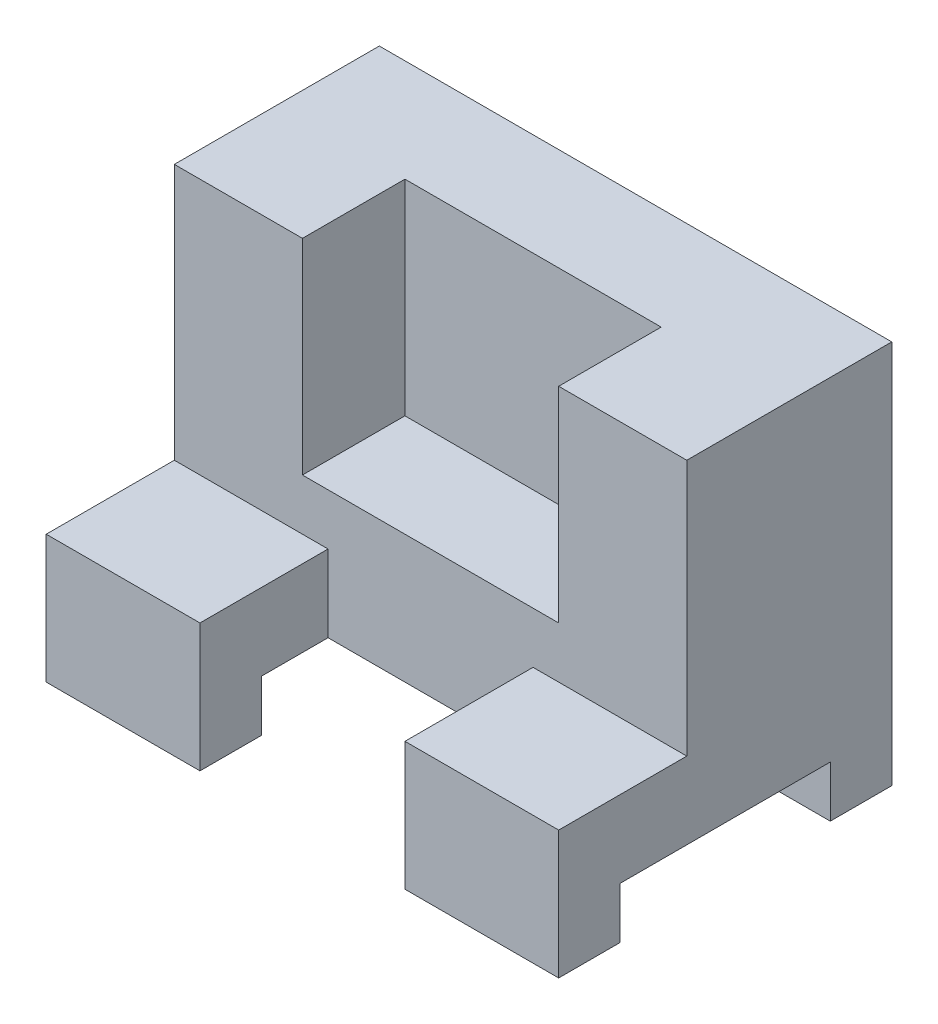
ISO-10303-21;
HEADER;
FILE_DESCRIPTION(('STEP AP214'),'2;1');
FILE_NAME('part.step','',(''),(''),'','','');
FILE_SCHEMA(('AUTOMOTIVE_DESIGN { 1 0 10303 214 1 1 1 1 }'));
ENDSEC;
DATA;
#1=APPLICATION_CONTEXT('core data for automotive mechanical design processes');
#2=APPLICATION_PROTOCOL_DEFINITION('international standard','automotive_design',2000,#1);
#3=PRODUCT_CONTEXT('',#1,'mechanical');
#4=PRODUCT('Part','Part','',(#3));
#5=PRODUCT_RELATED_PRODUCT_CATEGORY('part','',(#4));
#6=PRODUCT_DEFINITION_FORMATION('','',#4);
#7=PRODUCT_DEFINITION_CONTEXT('part definition',#1,'design');
#8=PRODUCT_DEFINITION('design','',#6,#7);
#9=PRODUCT_DEFINITION_SHAPE('','',#8);
#10=(LENGTH_UNIT() NAMED_UNIT(*) SI_UNIT(.MILLI.,.METRE.));
#11=(NAMED_UNIT(*) PLANE_ANGLE_UNIT() SI_UNIT($,.RADIAN.));
#12=(NAMED_UNIT(*) SI_UNIT($,.STERADIAN.) SOLID_ANGLE_UNIT());
#13=UNCERTAINTY_MEASURE_WITH_UNIT(LENGTH_MEASURE(1.E-05),#10,'distance_accuracy_value','');
#14=(GEOMETRIC_REPRESENTATION_CONTEXT(3) GLOBAL_UNCERTAINTY_ASSIGNED_CONTEXT((#13)) GLOBAL_UNIT_ASSIGNED_CONTEXT((#10,
#11,#12)) REPRESENTATION_CONTEXT('',''));
#15=CARTESIAN_POINT('',(0.,0.,0.));
#16=DIRECTION('',(0.,0.,1.));
#17=DIRECTION('',(1.,0.,0.));
#18=AXIS2_PLACEMENT_3D('',#15,#16,#17);
#19=CARTESIAN_POINT('',(-56.1561561561562,75.,22.5075075075075));
#20=DIRECTION('',(0.,0.,-1.));
#21=DIRECTION('',(-1.,0.,0.));
#22=AXIS2_PLACEMENT_3D('',#19,#20,#21);
#23=PLANE('',#22);
#24=DIRECTION('',(0.,1.,0.));
#25=VECTOR('',#24,1.);
#26=CARTESIAN_POINT('',(-26.1561561561562,-15.,22.5075075075075));
#27=LINE('',#26,#25);
#28=CARTESIAN_POINT('',(-26.1561561561562,0.,22.5075075075075));
#29=VERTEX_POINT('',#28);
#30=CARTESIAN_POINT('',(-26.1561561561562,25.,22.5075075075075));
#31=VERTEX_POINT('',#30);
#32=EDGE_CURVE('E223',#29,#31,#27,.T.);
#33=ORIENTED_EDGE('',*,*,#32,.T.);
#34=DIRECTION('',(1.,0.,0.));
#35=VECTOR('',#34,1.);
#36=CARTESIAN_POINT('',(-56.1561561561562,25.,22.5075075075075));
#37=LINE('',#36,#35);
#38=CARTESIAN_POINT('',(-56.1561561561562,25.,22.5075075075075));
#39=VERTEX_POINT('',#38);
#40=EDGE_CURVE('E236',#39,#31,#37,.T.);
#41=ORIENTED_EDGE('',*,*,#40,.F.);
#42=DIRECTION('',(0.,-1.,0.));
#43=VECTOR('',#42,1.);
#44=CARTESIAN_POINT('',(-56.1561561561562,75.,22.5075075075075));
#45=LINE('',#44,#43);
#46=CARTESIAN_POINT('',(-56.1561561561562,0.,22.5075075075075));
#47=VERTEX_POINT('',#46);
#48=EDGE_CURVE('E301',#39,#47,#45,.T.);
#49=ORIENTED_EDGE('',*,*,#48,.T.);
#50=DIRECTION('',(1.,0.,0.));
#51=VECTOR('',#50,1.);
#52=CARTESIAN_POINT('',(-56.1561561561562,0.,22.5075075075075));
#53=LINE('',#52,#51);
#54=EDGE_CURVE('E239',#47,#29,#53,.T.);
#55=ORIENTED_EDGE('',*,*,#54,.T.);
#56=EDGE_LOOP('',(#33,#41,#49,#55));
#57=FACE_BOUND('',#56,.T.);
#58=ADVANCED_FACE('F82',(#57),#23,.F.);
#59=CARTESIAN_POINT('',(0.,0.,0.));
#60=DIRECTION('',(0.,-1.,0.));
#61=DIRECTION('',(0.,0.,-1.));
#62=AXIS2_PLACEMENT_3D('',#59,#60,#61);
#63=PLANE('',#62);
#64=DIRECTION('',(-1.,0.,0.));
#65=VECTOR('',#64,1.);
#66=CARTESIAN_POINT('',(0.,0.,10.5075075075075));
#67=LINE('',#66,#65);
#68=CARTESIAN_POINT('',(-26.1561561561562,0.,10.5075075075075));
#69=VERTEX_POINT('',#68);
#70=CARTESIAN_POINT('',(-56.1561561561562,0.,10.5075075075075));
#71=VERTEX_POINT('',#70);
#72=EDGE_CURVE('E304',#69,#71,#67,.T.);
#73=ORIENTED_EDGE('',*,*,#72,.F.);
#74=DIRECTION('',(0.,0.,1.));
#75=VECTOR('',#74,1.);
#76=CARTESIAN_POINT('',(-26.1561561561562,0.,0.));
#77=LINE('',#76,#75);
#78=EDGE_CURVE('E321',#69,#29,#77,.T.);
#79=ORIENTED_EDGE('',*,*,#78,.T.);
#80=ORIENTED_EDGE('',*,*,#54,.F.);
#81=DIRECTION('',(0.,0.,1.));
#82=VECTOR('',#81,1.);
#83=CARTESIAN_POINT('',(-56.1561561561562,0.,22.5075075075075));
#84=LINE('',#83,#82);
#85=EDGE_CURVE('E274',#71,#47,#84,.T.);
#86=ORIENTED_EDGE('',*,*,#85,.F.);
#87=EDGE_LOOP('',(#73,#79,#80,#86));
#88=FACE_BOUND('',#87,.T.);
#89=ADVANCED_FACE('F320',(#88),#63,.T.);
#90=CARTESIAN_POINT('',(-97.1561561561562,10.,-30.4924924924925));
#91=DIRECTION('',(0.,1.,0.));
#92=DIRECTION('',(0.,0.,1.));
#93=AXIS2_PLACEMENT_3D('',#90,#91,#92);
#94=PLANE('',#93);
#95=DIRECTION('',(0.,0.,-1.));
#96=VECTOR('',#95,1.);
#97=CARTESIAN_POINT('',(-26.1561561561562,10.,-30.4924924924925));
#98=LINE('',#97,#96);
#99=CARTESIAN_POINT('',(-26.1561561561562,10.,10.5075075075075));
#100=VERTEX_POINT('',#99);
#101=CARTESIAN_POINT('',(-26.1561561561562,10.,-2.49249249249248));
#102=VERTEX_POINT('',#101);
#103=EDGE_CURVE('E323',#100,#102,#98,.T.);
#104=ORIENTED_EDGE('',*,*,#103,.F.);
#105=DIRECTION('',(1.,0.,0.));
#106=VECTOR('',#105,1.);
#107=CARTESIAN_POINT('',(-97.1561561561562,10.,10.5075075075075));
#108=LINE('',#107,#106);
#109=CARTESIAN_POINT('',(-56.1561561561562,10.,10.5075075075075));
#110=VERTEX_POINT('',#109);
#111=EDGE_CURVE('E260',#110,#100,#108,.T.);
#112=ORIENTED_EDGE('',*,*,#111,.F.);
#113=DIRECTION('',(0.,0.,1.));
#114=VECTOR('',#113,1.);
#115=CARTESIAN_POINT('',(-56.1561561561562,9.99999999999999,22.5075075075075));
#116=LINE('',#115,#114);
#117=CARTESIAN_POINT('',(-56.1561561561562,10.,-30.4924924924925));
#118=VERTEX_POINT('',#117);
#119=EDGE_CURVE('E271',#118,#110,#116,.T.);
#120=ORIENTED_EDGE('',*,*,#119,.F.);
#121=DIRECTION('',(1.,0.,0.));
#122=VECTOR('',#121,1.);
#123=CARTESIAN_POINT('',(-97.1561561561562,10.,-30.4924924924925));
#124=LINE('',#123,#122);
#125=CARTESIAN_POINT('',(43.8438438438438,10.,-30.4924924924925));
#126=VERTEX_POINT('',#125);
#127=EDGE_CURVE('E259',#118,#126,#124,.T.);
#128=ORIENTED_EDGE('',*,*,#127,.T.);
#129=DIRECTION('',(0.,0.,1.));
#130=VECTOR('',#129,1.);
#131=CARTESIAN_POINT('',(43.8438438438438,10.,-30.4924924924925));
#132=LINE('',#131,#130);
#133=CARTESIAN_POINT('',(43.8438438438438,10.,10.5075075075075));
#134=VERTEX_POINT('',#133);
#135=EDGE_CURVE('E254',#126,#134,#132,.T.);
#136=ORIENTED_EDGE('',*,*,#135,.T.);
#137=CARTESIAN_POINT('',(13.8438438438438,10.,10.5075075075075));
#138=VERTEX_POINT('',#137);
#139=EDGE_CURVE('E264',#138,#134,#108,.T.);
#140=ORIENTED_EDGE('',*,*,#139,.F.);
#141=DIRECTION('',(0.,0.,-1.));
#142=VECTOR('',#141,1.);
#143=CARTESIAN_POINT('',(13.8438438438438,10.,-30.4924924924925));
#144=LINE('',#143,#142);
#145=CARTESIAN_POINT('',(13.8438438438438,10.,-2.49249249249248));
#146=VERTEX_POINT('',#145);
#147=EDGE_CURVE('E388',#138,#146,#144,.T.);
#148=ORIENTED_EDGE('',*,*,#147,.T.);
#149=DIRECTION('',(-1.,0.,0.));
#150=VECTOR('',#149,1.);
#151=CARTESIAN_POINT('',(-97.1561561561562,10.,-2.49249249249248));
#152=LINE('',#151,#150);
#153=EDGE_CURVE('E378',#146,#102,#152,.T.);
#154=ORIENTED_EDGE('',*,*,#153,.T.);
#155=EDGE_LOOP('',(#104,#112,#120,#128,#136,#140,#148,#154));
#156=FACE_BOUND('',#155,.T.);
#157=ADVANCED_FACE('F394',(#156),#94,.F.);
#158=CARTESIAN_POINT('',(-97.1561561561562,0.,10.5075075075075));
#159=DIRECTION('',(0.,0.,1.));
#160=DIRECTION('',(1.,0.,0.));
#161=AXIS2_PLACEMENT_3D('',#158,#159,#160);
#162=PLANE('',#161);
#163=DIRECTION('',(0.,1.,0.));
#164=VECTOR('',#163,1.);
#165=CARTESIAN_POINT('',(-26.1561561561562,0.,10.5075075075075));
#166=LINE('',#165,#164);
#167=EDGE_CURVE('E315',#69,#100,#166,.T.);
#168=ORIENTED_EDGE('',*,*,#167,.F.);
#169=ORIENTED_EDGE('',*,*,#72,.T.);
#170=DIRECTION('',(0.,-1.,0.));
#171=VECTOR('',#170,1.);
#172=CARTESIAN_POINT('',(-56.1561561561562,75.,10.5075075075075));
#173=LINE('',#172,#171);
#174=EDGE_CURVE('E268',#110,#71,#173,.T.);
#175=ORIENTED_EDGE('',*,*,#174,.F.);
#176=ORIENTED_EDGE('',*,*,#111,.T.);
#177=EDGE_LOOP('',(#168,#169,#175,#176));
#178=FACE_BOUND('',#177,.T.);
#179=ADVANCED_FACE('F313',(#178),#162,.F.);
#180=CARTESIAN_POINT('',(-6.15615615615616,25.,-9.99249249249248));
#181=DIRECTION('',(0.,1.,0.));
#182=DIRECTION('',(0.,0.,1.));
#183=AXIS2_PLACEMENT_3D('',#180,#181,#182);
#184=PLANE('',#183);
#185=ORIENTED_EDGE('',*,*,#40,.T.);
#186=DIRECTION('',(0.,0.,-1.));
#187=VECTOR('',#186,1.);
#188=CARTESIAN_POINT('',(-26.1561561561562,25.,0.));
#189=LINE('',#188,#187);
#190=CARTESIAN_POINT('',(-26.1561561561562,25.,-2.49249249249248));
#191=VERTEX_POINT('',#190);
#192=EDGE_CURVE('E220',#31,#191,#189,.T.);
#193=ORIENTED_EDGE('',*,*,#192,.T.);
#194=DIRECTION('',(1.,0.,0.));
#195=VECTOR('',#194,1.);
#196=CARTESIAN_POINT('',(0.,25.,-2.49249249249248));
#197=LINE('',#196,#195);
#198=CARTESIAN_POINT('',(-56.1561561561562,25.,-2.49249249249248));
#199=VERTEX_POINT('',#198);
#200=EDGE_CURVE('E353',#199,#191,#197,.T.);
#201=ORIENTED_EDGE('',*,*,#200,.F.);
#202=DIRECTION('',(0.,0.,1.));
#203=VECTOR('',#202,1.);
#204=CARTESIAN_POINT('',(-56.1561561561562,25.,22.5075075075075));
#205=LINE('',#204,#203);
#206=EDGE_CURVE('E243',#199,#39,#205,.T.);
#207=ORIENTED_EDGE('',*,*,#206,.T.);
#208=EDGE_LOOP('',(#185,#193,#201,#207));
#209=FACE_BOUND('',#208,.T.);
#210=ADVANCED_FACE('F241',(#209),#184,.T.);
#211=CARTESIAN_POINT('',(0.,75.,0.));
#212=DIRECTION('',(0.,-1.,0.));
#213=DIRECTION('',(0.,0.,-1.));
#214=AXIS2_PLACEMENT_3D('',#211,#212,#213);
#215=PLANE('',#214);
#216=DIRECTION('',(0.,0.,1.));
#217=VECTOR('',#216,1.);
#218=CARTESIAN_POINT('',(18.8438438438438,75.,0.));
#219=LINE('',#218,#217);
#220=CARTESIAN_POINT('',(18.8438438438438,75.,-22.4924924924925));
#221=VERTEX_POINT('',#220);
#222=CARTESIAN_POINT('',(18.8438438438438,75.,-2.49249249249248));
#223=VERTEX_POINT('',#222);
#224=EDGE_CURVE('E322',#221,#223,#219,.T.);
#225=ORIENTED_EDGE('',*,*,#224,.T.);
#226=DIRECTION('',(1.,0.,0.));
#227=VECTOR('',#226,1.);
#228=CARTESIAN_POINT('',(0.,75.,-2.49249249249248));
#229=LINE('',#228,#227);
#230=CARTESIAN_POINT('',(43.8438438438438,75.,-2.49249249249248));
#231=VERTEX_POINT('',#230);
#232=EDGE_CURVE('E90',#223,#231,#229,.T.);
#233=ORIENTED_EDGE('',*,*,#232,.T.);
#234=DIRECTION('',(0.,0.,-1.));
#235=VECTOR('',#234,1.);
#236=CARTESIAN_POINT('',(43.8438438438438,75.,22.5075075075075));
#237=LINE('',#236,#235);
#238=CARTESIAN_POINT('',(43.8438438438438,75.,-42.4924924924925));
#239=VERTEX_POINT('',#238);
#240=EDGE_CURVE('E278',#231,#239,#237,.T.);
#241=ORIENTED_EDGE('',*,*,#240,.T.);
#242=DIRECTION('',(-1.,0.,0.));
#243=VECTOR('',#242,1.);
#244=CARTESIAN_POINT('',(-56.1561561561562,75.,-42.4924924924925));
#245=LINE('',#244,#243);
#246=CARTESIAN_POINT('',(-56.1561561561562,75.,-42.4924924924925));
#247=VERTEX_POINT('',#246);
#248=EDGE_CURVE('E281',#239,#247,#245,.T.);
#249=ORIENTED_EDGE('',*,*,#248,.T.);
#250=DIRECTION('',(0.,0.,1.));
#251=VECTOR('',#250,1.);
#252=CARTESIAN_POINT('',(-56.1561561561562,75.,22.5075075075075));
#253=LINE('',#252,#251);
#254=CARTESIAN_POINT('',(-56.1561561561562,75.,-2.49249249249248));
#255=VERTEX_POINT('',#254);
#256=EDGE_CURVE('E275',#247,#255,#253,.T.);
#257=ORIENTED_EDGE('',*,*,#256,.T.);
#258=CARTESIAN_POINT('',(-31.1561561561562,75.,-2.49249249249248));
#259=VERTEX_POINT('',#258);
#260=EDGE_CURVE('E13',#255,#259,#229,.T.);
#261=ORIENTED_EDGE('',*,*,#260,.T.);
#262=DIRECTION('',(0.,0.,-1.));
#263=VECTOR('',#262,1.);
#264=CARTESIAN_POINT('',(-31.1561561561562,75.,0.));
#265=LINE('',#264,#263);
#266=CARTESIAN_POINT('',(-31.1561561561562,75.,-22.4924924924925));
#267=VERTEX_POINT('',#266);
#268=EDGE_CURVE('E334',#259,#267,#265,.T.);
#269=ORIENTED_EDGE('',*,*,#268,.T.);
#270=DIRECTION('',(1.,0.,0.));
#271=VECTOR('',#270,1.);
#272=CARTESIAN_POINT('',(0.,75.,-22.4924924924925));
#273=LINE('',#272,#271);
#274=EDGE_CURVE('E326',#267,#221,#273,.T.);
#275=ORIENTED_EDGE('',*,*,#274,.T.);
#276=EDGE_LOOP('',(#225,#233,#241,#249,#257,#261,#269,#275));
#277=FACE_BOUND('',#276,.T.);
#278=ADVANCED_FACE('F415',(#277),#215,.F.);
#279=CARTESIAN_POINT('',(0.,75.000012,-2.49249249249248));
#280=DIRECTION('',(0.,0.,-1.));
#281=DIRECTION('',(-1.,0.,0.));
#282=AXIS2_PLACEMENT_3D('',#279,#280,#281);
#283=PLANE('',#282);
#284=DIRECTION('',(0.,1.,0.));
#285=VECTOR('',#284,1.);
#286=CARTESIAN_POINT('',(18.8438438438438,35.,-2.49249249249248));
#287=LINE('',#286,#285);
#288=CARTESIAN_POINT('',(18.8438438438438,35.,-2.49249249249248));
#289=VERTEX_POINT('',#288);
#290=EDGE_CURVE('E344',#289,#223,#287,.T.);
#291=ORIENTED_EDGE('',*,*,#290,.F.);
#292=DIRECTION('',(1.,0.,0.));
#293=VECTOR('',#292,1.);
#294=CARTESIAN_POINT('',(0.,35.,-2.49249249249248));
#295=LINE('',#294,#293);
#296=CARTESIAN_POINT('',(-31.1561561561562,35.,-2.49249249249248));
#297=VERTEX_POINT('',#296);
#298=EDGE_CURVE('E337',#297,#289,#295,.T.);
#299=ORIENTED_EDGE('',*,*,#298,.F.);
#300=DIRECTION('',(0.,1.,0.));
#301=VECTOR('',#300,1.);
#302=CARTESIAN_POINT('',(-31.1561561561562,35.,-2.49249249249248));
#303=LINE('',#302,#301);
#304=EDGE_CURVE('E347',#297,#259,#303,.T.);
#305=ORIENTED_EDGE('',*,*,#304,.T.);
#306=ORIENTED_EDGE('',*,*,#260,.F.);
#307=DIRECTION('',(0.,-1.,0.));
#308=VECTOR('',#307,1.);
#309=CARTESIAN_POINT('',(-56.1561561561562,75.000012,-2.49249249249248));
#310=LINE('',#309,#308);
#311=EDGE_CURVE('E357',#255,#199,#310,.T.);
#312=ORIENTED_EDGE('',*,*,#311,.T.);
#313=ORIENTED_EDGE('',*,*,#200,.T.);
#314=DIRECTION('',(0.,1.,0.));
#315=VECTOR('',#314,1.);
#316=CARTESIAN_POINT('',(-26.1561561561562,-15.,-2.49249249249248));
#317=LINE('',#316,#315);
#318=EDGE_CURVE('E226',#102,#191,#317,.T.);
#319=ORIENTED_EDGE('',*,*,#318,.F.);
#320=ORIENTED_EDGE('',*,*,#153,.F.);
#321=DIRECTION('',(0.,1.,0.));
#322=VECTOR('',#321,1.);
#323=CARTESIAN_POINT('',(13.8438438438438,-15.,-2.49249249249248));
#324=LINE('',#323,#322);
#325=CARTESIAN_POINT('',(13.8438438438438,25.,-2.49249249249248));
#326=VERTEX_POINT('',#325);
#327=EDGE_CURVE('E376',#146,#326,#324,.T.);
#328=ORIENTED_EDGE('',*,*,#327,.T.);
#329=CARTESIAN_POINT('',(43.8438438438438,25.,-2.49249249249248));
#330=VERTEX_POINT('',#329);
#331=EDGE_CURVE('E346',#326,#330,#197,.T.);
#332=ORIENTED_EDGE('',*,*,#331,.T.);
#333=DIRECTION('',(0.,-1.,0.));
#334=VECTOR('',#333,1.);
#335=CARTESIAN_POINT('',(43.8438438438438,75.000012,-2.49249249249248));
#336=LINE('',#335,#334);
#337=EDGE_CURVE('E355',#231,#330,#336,.T.);
#338=ORIENTED_EDGE('',*,*,#337,.F.);
#339=ORIENTED_EDGE('',*,*,#232,.F.);
#340=EDGE_LOOP('',(#291,#299,#305,#306,#312,#313,#319,#320,#328,#332,#338,#339));
#341=FACE_BOUND('',#340,.T.);
#342=ADVANCED_FACE('F374',(#341),#283,.F.);
#343=CARTESIAN_POINT('',(13.8438438438438,25.,22.5075075075075));
#344=VERTEX_POINT('',#343);
#345=CARTESIAN_POINT('',(43.8438438438438,25.,22.5075075075075));
#346=VERTEX_POINT('',#345);
#347=EDGE_CURVE('E244',#344,#346,#37,.T.);
#348=ORIENTED_EDGE('',*,*,#347,.F.);
#349=DIRECTION('',(0.,1.,0.));
#350=VECTOR('',#349,1.);
#351=CARTESIAN_POINT('',(13.8438438438438,-15.,22.5075075075075));
#352=LINE('',#351,#350);
#353=CARTESIAN_POINT('',(13.8438438438438,0.,22.5075075075075));
#354=VERTEX_POINT('',#353);
#355=EDGE_CURVE('E97',#354,#344,#352,.T.);
#356=ORIENTED_EDGE('',*,*,#355,.F.);
#357=CARTESIAN_POINT('',(43.8438438438438,0.,22.5075075075075));
#358=VERTEX_POINT('',#357);
#359=EDGE_CURVE('E287',#354,#358,#53,.T.);
#360=ORIENTED_EDGE('',*,*,#359,.T.);
#361=DIRECTION('',(0.,-1.,0.));
#362=VECTOR('',#361,1.);
#363=CARTESIAN_POINT('',(43.8438438438438,75.,22.5075075075075));
#364=LINE('',#363,#362);
#365=EDGE_CURVE('E298',#346,#358,#364,.T.);
#366=ORIENTED_EDGE('',*,*,#365,.F.);
#367=EDGE_LOOP('',(#348,#356,#360,#366));
#368=FACE_BOUND('',#367,.T.);
#369=ADVANCED_FACE('F407',(#368),#23,.F.);
#370=DIRECTION('',(0.,0.,1.));
#371=VECTOR('',#370,1.);
#372=CARTESIAN_POINT('',(13.8438438438438,0.,0.));
#373=LINE('',#372,#371);
#374=CARTESIAN_POINT('',(13.8438438438438,0.,10.5075075075075));
#375=VERTEX_POINT('',#374);
#376=EDGE_CURVE('E390',#375,#354,#373,.T.);
#377=ORIENTED_EDGE('',*,*,#376,.F.);
#378=CARTESIAN_POINT('',(43.8438438438438,0.,10.5075075075075));
#379=VERTEX_POINT('',#378);
#380=EDGE_CURVE('E305',#379,#375,#67,.T.);
#381=ORIENTED_EDGE('',*,*,#380,.F.);
#382=DIRECTION('',(0.,0.,-1.));
#383=VECTOR('',#382,1.);
#384=CARTESIAN_POINT('',(43.8438438438438,0.,22.5075075075075));
#385=LINE('',#384,#383);
#386=EDGE_CURVE('E290',#358,#379,#385,.T.);
#387=ORIENTED_EDGE('',*,*,#386,.F.);
#388=ORIENTED_EDGE('',*,*,#359,.F.);
#389=EDGE_LOOP('',(#377,#381,#387,#388));
#390=FACE_BOUND('',#389,.T.);
#391=ADVANCED_FACE('F405',(#390),#63,.T.);
#392=CARTESIAN_POINT('',(-56.1561561561562,75.,22.5075075075075));
#393=DIRECTION('',(1.,0.,0.));
#394=DIRECTION('',(0.,0.,-1.));
#395=AXIS2_PLACEMENT_3D('',#392,#393,#394);
#396=PLANE('',#395);
#397=DIRECTION('',(0.,-1.,0.));
#398=VECTOR('',#397,1.);
#399=CARTESIAN_POINT('',(-56.1561561561562,75.,-42.4924924924925));
#400=LINE('',#399,#398);
#401=CARTESIAN_POINT('',(-56.1561561561562,0.,-42.4924924924925));
#402=VERTEX_POINT('',#401);
#403=EDGE_CURVE('E283',#247,#402,#400,.T.);
#404=ORIENTED_EDGE('',*,*,#403,.T.);
#405=CARTESIAN_POINT('',(-56.1561561561562,0.,-30.4924924924925));
#406=VERTEX_POINT('',#405);
#407=EDGE_CURVE('E284',#402,#406,#84,.T.);
#408=ORIENTED_EDGE('',*,*,#407,.T.);
#409=DIRECTION('',(0.,1.,0.));
#410=VECTOR('',#409,1.);
#411=CARTESIAN_POINT('',(-56.1561561561562,75.,-30.4924924924925));
#412=LINE('',#411,#410);
#413=EDGE_CURVE('E263',#406,#118,#412,.T.);
#414=ORIENTED_EDGE('',*,*,#413,.T.);
#415=ORIENTED_EDGE('',*,*,#119,.T.);
#416=ORIENTED_EDGE('',*,*,#174,.T.);
#417=ORIENTED_EDGE('',*,*,#85,.T.);
#418=ORIENTED_EDGE('',*,*,#48,.F.);
#419=ORIENTED_EDGE('',*,*,#206,.F.);
#420=ORIENTED_EDGE('',*,*,#311,.F.);
#421=ORIENTED_EDGE('',*,*,#256,.F.);
#422=EDGE_LOOP('',(#404,#408,#414,#415,#416,#417,#418,#419,#420,#421));
#423=FACE_BOUND('',#422,.T.);
#424=ADVANCED_FACE('F84',(#423),#396,.F.);
#425=CARTESIAN_POINT('',(43.8438438438438,75.,22.5075075075075));
#426=DIRECTION('',(-1.,0.,0.));
#427=DIRECTION('',(0.,0.,1.));
#428=AXIS2_PLACEMENT_3D('',#425,#426,#427);
#429=PLANE('',#428);
#430=ORIENTED_EDGE('',*,*,#240,.F.);
#431=ORIENTED_EDGE('',*,*,#337,.T.);
#432=DIRECTION('',(0.,0.,-1.));
#433=VECTOR('',#432,1.);
#434=CARTESIAN_POINT('',(43.8438438438438,25.,22.5075075075075));
#435=LINE('',#434,#433);
#436=EDGE_CURVE('E248',#346,#330,#435,.T.);
#437=ORIENTED_EDGE('',*,*,#436,.F.);
#438=ORIENTED_EDGE('',*,*,#365,.T.);
#439=ORIENTED_EDGE('',*,*,#386,.T.);
#440=DIRECTION('',(0.,-1.,0.));
#441=VECTOR('',#440,1.);
#442=CARTESIAN_POINT('',(43.8438438438438,0.,10.5075075075075));
#443=LINE('',#442,#441);
#444=EDGE_CURVE('E257',#134,#379,#443,.T.);
#445=ORIENTED_EDGE('',*,*,#444,.F.);
#446=ORIENTED_EDGE('',*,*,#135,.F.);
#447=DIRECTION('',(0.,1.,0.));
#448=VECTOR('',#447,1.);
#449=CARTESIAN_POINT('',(43.8438438438438,0.,-30.4924924924925));
#450=LINE('',#449,#448);
#451=CARTESIAN_POINT('',(43.8438438438438,0.,-30.4924924924925));
#452=VERTEX_POINT('',#451);
#453=EDGE_CURVE('E246',#452,#126,#450,.T.);
#454=ORIENTED_EDGE('',*,*,#453,.F.);
#455=CARTESIAN_POINT('',(43.8438438438438,0.,-42.4924924924925));
#456=VERTEX_POINT('',#455);
#457=EDGE_CURVE('E289',#452,#456,#385,.T.);
#458=ORIENTED_EDGE('',*,*,#457,.T.);
#459=DIRECTION('',(0.,-1.,0.));
#460=VECTOR('',#459,1.);
#461=CARTESIAN_POINT('',(43.8438438438438,75.,-42.4924924924925));
#462=LINE('',#461,#460);
#463=EDGE_CURVE('E296',#239,#456,#462,.T.);
#464=ORIENTED_EDGE('',*,*,#463,.F.);
#465=EDGE_LOOP('',(#430,#431,#437,#438,#439,#445,#446,#454,#458,#464));
#466=FACE_BOUND('',#465,.T.);
#467=ADVANCED_FACE('F370',(#466),#429,.F.);
#468=CARTESIAN_POINT('',(-56.1561561561562,75.,-42.4924924924925));
#469=DIRECTION('',(0.,0.,1.));
#470=DIRECTION('',(1.,0.,0.));
#471=AXIS2_PLACEMENT_3D('',#468,#469,#470);
#472=PLANE('',#471);
#473=ORIENTED_EDGE('',*,*,#463,.T.);
#474=DIRECTION('',(-1.,0.,0.));
#475=VECTOR('',#474,1.);
#476=CARTESIAN_POINT('',(-56.1561561561562,0.,-42.4924924924925));
#477=LINE('',#476,#475);
#478=EDGE_CURVE('E279',#456,#402,#477,.T.);
#479=ORIENTED_EDGE('',*,*,#478,.T.);
#480=ORIENTED_EDGE('',*,*,#403,.F.);
#481=ORIENTED_EDGE('',*,*,#248,.F.);
#482=EDGE_LOOP('',(#473,#479,#480,#481));
#483=FACE_BOUND('',#482,.T.);
#484=ADVANCED_FACE('F429',(#483),#472,.F.);
#485=DIRECTION('',(1.,0.,0.));
#486=VECTOR('',#485,1.);
#487=CARTESIAN_POINT('',(0.,0.,-30.4924924924925));
#488=LINE('',#487,#486);
#489=EDGE_CURVE('E303',#406,#452,#488,.T.);
#490=ORIENTED_EDGE('',*,*,#489,.F.);
#491=ORIENTED_EDGE('',*,*,#407,.F.);
#492=ORIENTED_EDGE('',*,*,#478,.F.);
#493=ORIENTED_EDGE('',*,*,#457,.F.);
#494=EDGE_LOOP('',(#490,#491,#492,#493));
#495=FACE_BOUND('',#494,.T.);
#496=ADVANCED_FACE('F414',(#495),#63,.T.);
#497=ORIENTED_EDGE('',*,*,#380,.T.);
#498=DIRECTION('',(0.,1.,0.));
#499=VECTOR('',#498,1.);
#500=CARTESIAN_POINT('',(13.8438438438438,0.,10.5075075075075));
#501=LINE('',#500,#499);
#502=EDGE_CURVE('E384',#375,#138,#501,.T.);
#503=ORIENTED_EDGE('',*,*,#502,.T.);
#504=ORIENTED_EDGE('',*,*,#139,.T.);
#505=ORIENTED_EDGE('',*,*,#444,.T.);
#506=EDGE_LOOP('',(#497,#503,#504,#505));
#507=FACE_BOUND('',#506,.T.);
#508=ADVANCED_FACE('F397',(#507),#162,.F.);
#509=CARTESIAN_POINT('',(-97.1561561561562,0.,-30.4924924924925));
#510=DIRECTION('',(0.,0.,-1.));
#511=DIRECTION('',(-1.,0.,0.));
#512=AXIS2_PLACEMENT_3D('',#509,#510,#511);
#513=PLANE('',#512);
#514=ORIENTED_EDGE('',*,*,#489,.T.);
#515=ORIENTED_EDGE('',*,*,#453,.T.);
#516=ORIENTED_EDGE('',*,*,#127,.F.);
#517=ORIENTED_EDGE('',*,*,#413,.F.);
#518=EDGE_LOOP('',(#514,#515,#516,#517));
#519=FACE_BOUND('',#518,.T.);
#520=ADVANCED_FACE('F435',(#519),#513,.F.);
#521=DIRECTION('',(0.,0.,-1.));
#522=VECTOR('',#521,1.);
#523=CARTESIAN_POINT('',(13.8438438438438,25.,0.));
#524=LINE('',#523,#522);
#525=EDGE_CURVE('E231',#344,#326,#524,.T.);
#526=ORIENTED_EDGE('',*,*,#525,.F.);
#527=ORIENTED_EDGE('',*,*,#347,.T.);
#528=ORIENTED_EDGE('',*,*,#436,.T.);
#529=ORIENTED_EDGE('',*,*,#331,.F.);
#530=EDGE_LOOP('',(#526,#527,#528,#529));
#531=FACE_BOUND('',#530,.T.);
#532=ADVANCED_FACE('F364',(#531),#184,.T.);
#533=CARTESIAN_POINT('',(18.8438438438438,35.,0.));
#534=DIRECTION('',(-1.,0.,0.));
#535=DIRECTION('',(0.,0.,1.));
#536=AXIS2_PLACEMENT_3D('',#533,#534,#535);
#537=PLANE('',#536);
#538=ORIENTED_EDGE('',*,*,#224,.F.);
#539=DIRECTION('',(0.,1.,0.));
#540=VECTOR('',#539,1.);
#541=CARTESIAN_POINT('',(18.8438438438438,35.,-22.4924924924925));
#542=LINE('',#541,#540);
#543=CARTESIAN_POINT('',(18.8438438438438,35.,-22.4924924924925));
#544=VERTEX_POINT('',#543);
#545=EDGE_CURVE('E338',#544,#221,#542,.T.);
#546=ORIENTED_EDGE('',*,*,#545,.F.);
#547=DIRECTION('',(0.,0.,1.));
#548=VECTOR('',#547,1.);
#549=CARTESIAN_POINT('',(18.8438438438438,35.,0.));
#550=LINE('',#549,#548);
#551=EDGE_CURVE('E331',#544,#289,#550,.T.);
#552=ORIENTED_EDGE('',*,*,#551,.T.);
#553=ORIENTED_EDGE('',*,*,#290,.T.);
#554=EDGE_LOOP('',(#538,#546,#552,#553));
#555=FACE_BOUND('',#554,.T.);
#556=ADVANCED_FACE('F452',(#555),#537,.T.);
#557=CARTESIAN_POINT('',(-31.1561561561562,35.,0.));
#558=DIRECTION('',(1.,0.,0.));
#559=DIRECTION('',(0.,0.,-1.));
#560=AXIS2_PLACEMENT_3D('',#557,#558,#559);
#561=PLANE('',#560);
#562=ORIENTED_EDGE('',*,*,#268,.F.);
#563=ORIENTED_EDGE('',*,*,#304,.F.);
#564=DIRECTION('',(0.,0.,-1.));
#565=VECTOR('',#564,1.);
#566=CARTESIAN_POINT('',(-31.1561561561562,35.,0.));
#567=LINE('',#566,#565);
#568=CARTESIAN_POINT('',(-31.1561561561562,35.,-22.4924924924925));
#569=VERTEX_POINT('',#568);
#570=EDGE_CURVE('E105',#297,#569,#567,.T.);
#571=ORIENTED_EDGE('',*,*,#570,.T.);
#572=DIRECTION('',(0.,1.,0.));
#573=VECTOR('',#572,1.);
#574=CARTESIAN_POINT('',(-31.1561561561562,35.,-22.4924924924925));
#575=LINE('',#574,#573);
#576=EDGE_CURVE('E350',#569,#267,#575,.T.);
#577=ORIENTED_EDGE('',*,*,#576,.T.);
#578=EDGE_LOOP('',(#562,#563,#571,#577));
#579=FACE_BOUND('',#578,.T.);
#580=ADVANCED_FACE('F470',(#579),#561,.T.);
#581=CARTESIAN_POINT('',(0.,35.,-22.4924924924925));
#582=DIRECTION('',(0.,0.,1.));
#583=DIRECTION('',(1.,0.,0.));
#584=AXIS2_PLACEMENT_3D('',#581,#582,#583);
#585=PLANE('',#584);
#586=ORIENTED_EDGE('',*,*,#274,.F.);
#587=ORIENTED_EDGE('',*,*,#576,.F.);
#588=DIRECTION('',(1.,0.,0.));
#589=VECTOR('',#588,1.);
#590=CARTESIAN_POINT('',(0.,35.,-22.4924924924925));
#591=LINE('',#590,#589);
#592=EDGE_CURVE('E333',#569,#544,#591,.T.);
#593=ORIENTED_EDGE('',*,*,#592,.T.);
#594=ORIENTED_EDGE('',*,*,#545,.T.);
#595=EDGE_LOOP('',(#586,#587,#593,#594));
#596=FACE_BOUND('',#595,.T.);
#597=ADVANCED_FACE('F468',(#596),#585,.T.);
#598=CARTESIAN_POINT('',(0.,35.,0.));
#599=DIRECTION('',(0.,1.,0.));
#600=DIRECTION('',(0.,0.,1.));
#601=AXIS2_PLACEMENT_3D('',#598,#599,#600);
#602=PLANE('',#601);
#603=ORIENTED_EDGE('',*,*,#551,.F.);
#604=ORIENTED_EDGE('',*,*,#592,.F.);
#605=ORIENTED_EDGE('',*,*,#570,.F.);
#606=ORIENTED_EDGE('',*,*,#298,.T.);
#607=EDGE_LOOP('',(#603,#604,#605,#606));
#608=FACE_BOUND('',#607,.T.);
#609=ADVANCED_FACE('F465',(#608),#602,.T.);
#610=CARTESIAN_POINT('',(-26.1561561561562,-15.,0.));
#611=DIRECTION('',(1.,0.,0.));
#612=DIRECTION('',(0.,0.,-1.));
#613=AXIS2_PLACEMENT_3D('',#610,#611,#612);
#614=PLANE('',#613);
#615=ORIENTED_EDGE('',*,*,#167,.T.);
#616=ORIENTED_EDGE('',*,*,#103,.T.);
#617=ORIENTED_EDGE('',*,*,#318,.T.);
#618=ORIENTED_EDGE('',*,*,#192,.F.);
#619=ORIENTED_EDGE('',*,*,#32,.F.);
#620=ORIENTED_EDGE('',*,*,#78,.F.);
#621=EDGE_LOOP('',(#615,#616,#617,#618,#619,#620));
#622=FACE_BOUND('',#621,.T.);
#623=ADVANCED_FACE('F222',(#622),#614,.T.);
#624=CARTESIAN_POINT('',(13.8438438438438,-15.,0.));
#625=DIRECTION('',(1.,0.,0.));
#626=DIRECTION('',(0.,0.,-1.));
#627=AXIS2_PLACEMENT_3D('',#624,#625,#626);
#628=PLANE('',#627);
#629=ORIENTED_EDGE('',*,*,#376,.T.);
#630=ORIENTED_EDGE('',*,*,#355,.T.);
#631=ORIENTED_EDGE('',*,*,#525,.T.);
#632=ORIENTED_EDGE('',*,*,#327,.F.);
#633=ORIENTED_EDGE('',*,*,#147,.F.);
#634=ORIENTED_EDGE('',*,*,#502,.F.);
#635=EDGE_LOOP('',(#629,#630,#631,#632,#633,#634));
#636=FACE_BOUND('',#635,.T.);
#637=ADVANCED_FACE('F381',(#636),#628,.F.);
#638=CLOSED_SHELL('',(#58,#89,#157,#179,#210,#278,#342,#369,#391,#424,#467,#484,#496,#508,#520,
#532,#556,#580,#597,#609,#623,#637));
#639=MANIFOLD_SOLID_BREP('B2',#638);
#640=ADVANCED_BREP_SHAPE_REPRESENTATION('',(#18,#639),#14);
#641=SHAPE_DEFINITION_REPRESENTATION(#9,#640);
ENDSEC;
END-ISO-10303-21;
